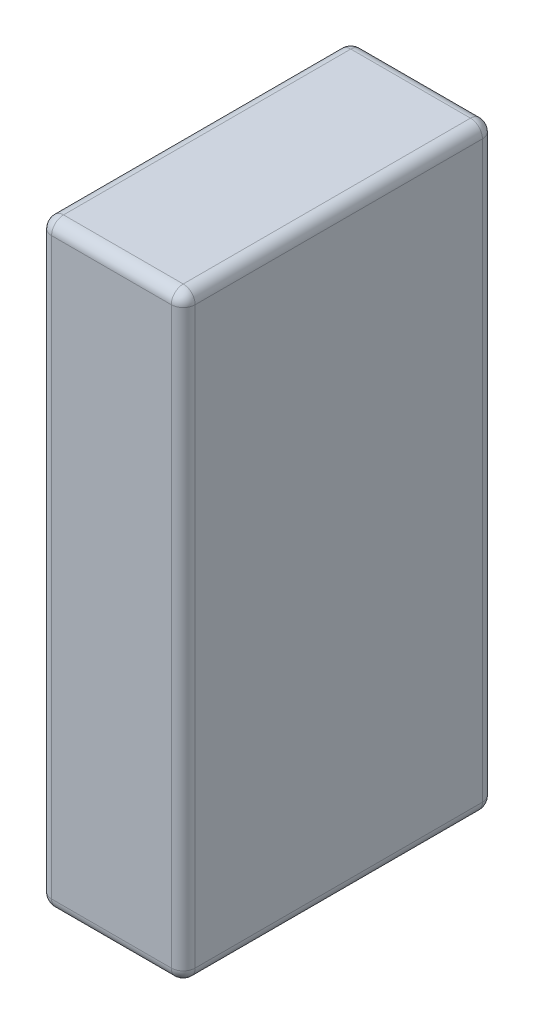
ISO-10303-21;
HEADER;
FILE_DESCRIPTION(('STEP AP214'),'2;1');
FILE_NAME('part.step','',(''),(''),'','','');
FILE_SCHEMA(('AUTOMOTIVE_DESIGN { 1 0 10303 214 1 1 1 1 }'));
ENDSEC;
DATA;
#1=APPLICATION_CONTEXT('core data for automotive mechanical design processes');
#2=APPLICATION_PROTOCOL_DEFINITION('international standard','automotive_design',2000,#1);
#3=PRODUCT_CONTEXT('',#1,'mechanical');
#4=PRODUCT('Part','Part','',(#3));
#5=PRODUCT_RELATED_PRODUCT_CATEGORY('part','',(#4));
#6=PRODUCT_DEFINITION_FORMATION('','',#4);
#7=PRODUCT_DEFINITION_CONTEXT('part definition',#1,'design');
#8=PRODUCT_DEFINITION('design','',#6,#7);
#9=PRODUCT_DEFINITION_SHAPE('','',#8);
#10=(LENGTH_UNIT() NAMED_UNIT(*) SI_UNIT(.MILLI.,.METRE.));
#11=(NAMED_UNIT(*) PLANE_ANGLE_UNIT() SI_UNIT($,.RADIAN.));
#12=(NAMED_UNIT(*) SI_UNIT($,.STERADIAN.) SOLID_ANGLE_UNIT());
#13=UNCERTAINTY_MEASURE_WITH_UNIT(LENGTH_MEASURE(1.E-05),#10,'distance_accuracy_value','');
#14=(GEOMETRIC_REPRESENTATION_CONTEXT(3) GLOBAL_UNCERTAINTY_ASSIGNED_CONTEXT((#13)) GLOBAL_UNIT_ASSIGNED_CONTEXT((#10,
#11,#12)) REPRESENTATION_CONTEXT('',''));
#15=CARTESIAN_POINT('',(0.,0.,0.));
#16=DIRECTION('',(0.,0.,1.));
#17=DIRECTION('',(1.,0.,0.));
#18=AXIS2_PLACEMENT_3D('',#15,#16,#17);
#19=CARTESIAN_POINT('',(60.,500.,130.));
#20=DIRECTION('',(-1.,0.,0.));
#21=DIRECTION('',(0.,0.,1.));
#22=AXIS2_PLACEMENT_3D('',#19,#20,#21);
#23=PLANE('',#22);
#24=DIRECTION('',(0.,0.,-1.));
#25=VECTOR('',#24,1.);
#26=CARTESIAN_POINT('',(60.,490.,130.));
#27=LINE('',#26,#25);
#28=CARTESIAN_POINT('',(60.,490.,-120.));
#29=VERTEX_POINT('',#28);
#30=CARTESIAN_POINT('',(60.,490.,120.));
#31=VERTEX_POINT('',#30);
#32=EDGE_CURVE('E48',#29,#31,#27,.F.);
#33=ORIENTED_EDGE('',*,*,#32,.T.);
#34=DIRECTION('',(0.,-1.,0.));
#35=VECTOR('',#34,1.);
#36=CARTESIAN_POINT('',(60.,500.,120.));
#37=LINE('',#36,#35);
#38=CARTESIAN_POINT('',(60.,10.,120.));
#39=VERTEX_POINT('',#38);
#40=EDGE_CURVE('E11',#31,#39,#37,.T.);
#41=ORIENTED_EDGE('',*,*,#40,.T.);
#42=DIRECTION('',(0.,0.,-1.));
#43=VECTOR('',#42,1.);
#44=CARTESIAN_POINT('',(60.,10.,-130.));
#45=LINE('',#44,#43);
#46=CARTESIAN_POINT('',(60.,10.,-120.));
#47=VERTEX_POINT('',#46);
#48=EDGE_CURVE('E204',#39,#47,#45,.T.);
#49=ORIENTED_EDGE('',*,*,#48,.T.);
#50=DIRECTION('',(0.,-1.,0.));
#51=VECTOR('',#50,1.);
#52=CARTESIAN_POINT('',(60.,500.,-120.));
#53=LINE('',#52,#51);
#54=EDGE_CURVE('E59',#47,#29,#53,.F.);
#55=ORIENTED_EDGE('',*,*,#54,.T.);
#56=EDGE_LOOP('',(#33,#41,#49,#55));
#57=FACE_BOUND('',#56,.T.);
#58=ADVANCED_FACE('F39',(#57),#23,.F.);
#59=CARTESIAN_POINT('',(-60.,500.,-130.));
#60=DIRECTION('',(0.,0.,1.));
#61=DIRECTION('',(1.,0.,0.));
#62=AXIS2_PLACEMENT_3D('',#59,#60,#61);
#63=PLANE('',#62);
#64=DIRECTION('',(-1.,0.,0.));
#65=VECTOR('',#64,1.);
#66=CARTESIAN_POINT('',(-60.,10.,-130.));
#67=LINE('',#66,#65);
#68=CARTESIAN_POINT('',(50.,10.,-130.));
#69=VERTEX_POINT('',#68);
#70=CARTESIAN_POINT('',(-50.,10.,-130.));
#71=VERTEX_POINT('',#70);
#72=EDGE_CURVE('E138',#69,#71,#67,.T.);
#73=ORIENTED_EDGE('',*,*,#72,.T.);
#74=DIRECTION('',(0.,-1.,0.));
#75=VECTOR('',#74,1.);
#76=CARTESIAN_POINT('',(-50.,500.,-130.));
#77=LINE('',#76,#75);
#78=CARTESIAN_POINT('',(-50.,490.,-130.));
#79=VERTEX_POINT('',#78);
#80=EDGE_CURVE('E134',#71,#79,#77,.F.);
#81=ORIENTED_EDGE('',*,*,#80,.T.);
#82=DIRECTION('',(-1.,0.,0.));
#83=VECTOR('',#82,1.);
#84=CARTESIAN_POINT('',(-60.,490.,-130.));
#85=LINE('',#84,#83);
#86=CARTESIAN_POINT('',(50.,490.,-130.));
#87=VERTEX_POINT('',#86);
#88=EDGE_CURVE('E126',#79,#87,#85,.F.);
#89=ORIENTED_EDGE('',*,*,#88,.T.);
#90=DIRECTION('',(0.,-1.,0.));
#91=VECTOR('',#90,1.);
#92=CARTESIAN_POINT('',(50.,500.,-130.));
#93=LINE('',#92,#91);
#94=EDGE_CURVE('E131',#87,#69,#93,.T.);
#95=ORIENTED_EDGE('',*,*,#94,.T.);
#96=EDGE_LOOP('',(#73,#81,#89,#95));
#97=FACE_BOUND('',#96,.T.);
#98=ADVANCED_FACE('F129',(#97),#63,.F.);
#99=CARTESIAN_POINT('',(-60.,500.,130.));
#100=DIRECTION('',(1.,0.,0.));
#101=DIRECTION('',(0.,0.,-1.));
#102=AXIS2_PLACEMENT_3D('',#99,#100,#101);
#103=PLANE('',#102);
#104=DIRECTION('',(0.,0.,1.));
#105=VECTOR('',#104,1.);
#106=CARTESIAN_POINT('',(-60.,490.,130.));
#107=LINE('',#106,#105);
#108=CARTESIAN_POINT('',(-60.,490.,120.));
#109=VERTEX_POINT('',#108);
#110=CARTESIAN_POINT('',(-60.,490.,-120.));
#111=VERTEX_POINT('',#110);
#112=EDGE_CURVE('E199',#109,#111,#107,.F.);
#113=ORIENTED_EDGE('',*,*,#112,.T.);
#114=DIRECTION('',(0.,-1.,0.));
#115=VECTOR('',#114,1.);
#116=CARTESIAN_POINT('',(-60.,500.,-120.));
#117=LINE('',#116,#115);
#118=CARTESIAN_POINT('',(-60.,10.,-120.));
#119=VERTEX_POINT('',#118);
#120=EDGE_CURVE('E201',#111,#119,#117,.T.);
#121=ORIENTED_EDGE('',*,*,#120,.T.);
#122=DIRECTION('',(0.,0.,1.));
#123=VECTOR('',#122,1.);
#124=CARTESIAN_POINT('',(-60.,10.,130.));
#125=LINE('',#124,#123);
#126=CARTESIAN_POINT('',(-60.,10.,120.));
#127=VERTEX_POINT('',#126);
#128=EDGE_CURVE('E195',#119,#127,#125,.T.);
#129=ORIENTED_EDGE('',*,*,#128,.T.);
#130=DIRECTION('',(0.,-1.,0.));
#131=VECTOR('',#130,1.);
#132=CARTESIAN_POINT('',(-60.,500.,120.));
#133=LINE('',#132,#131);
#134=EDGE_CURVE('E197',#127,#109,#133,.F.);
#135=ORIENTED_EDGE('',*,*,#134,.T.);
#136=EDGE_LOOP('',(#113,#121,#129,#135));
#137=FACE_BOUND('',#136,.T.);
#138=ADVANCED_FACE('F271',(#137),#103,.F.);
#139=CARTESIAN_POINT('',(-60.,500.,130.));
#140=DIRECTION('',(0.,0.,-1.));
#141=DIRECTION('',(-1.,0.,0.));
#142=AXIS2_PLACEMENT_3D('',#139,#140,#141);
#143=PLANE('',#142);
#144=DIRECTION('',(1.,0.,0.));
#145=VECTOR('',#144,1.);
#146=CARTESIAN_POINT('',(-60.,490.,130.));
#147=LINE('',#146,#145);
#148=CARTESIAN_POINT('',(50.,490.,130.));
#149=VERTEX_POINT('',#148);
#150=CARTESIAN_POINT('',(-50.,490.,130.));
#151=VERTEX_POINT('',#150);
#152=EDGE_CURVE('E180',#149,#151,#147,.F.);
#153=ORIENTED_EDGE('',*,*,#152,.T.);
#154=DIRECTION('',(0.,-1.,0.));
#155=VECTOR('',#154,1.);
#156=CARTESIAN_POINT('',(-50.,500.,130.));
#157=LINE('',#156,#155);
#158=CARTESIAN_POINT('',(-50.,10.,130.));
#159=VERTEX_POINT('',#158);
#160=EDGE_CURVE('E185',#151,#159,#157,.T.);
#161=ORIENTED_EDGE('',*,*,#160,.T.);
#162=DIRECTION('',(1.,0.,0.));
#163=VECTOR('',#162,1.);
#164=CARTESIAN_POINT('',(60.,10.,130.));
#165=LINE('',#164,#163);
#166=CARTESIAN_POINT('',(50.,10.,130.));
#167=VERTEX_POINT('',#166);
#168=EDGE_CURVE('E182',#159,#167,#165,.T.);
#169=ORIENTED_EDGE('',*,*,#168,.T.);
#170=DIRECTION('',(0.,-1.,0.));
#171=VECTOR('',#170,1.);
#172=CARTESIAN_POINT('',(50.,500.,130.));
#173=LINE('',#172,#171);
#174=EDGE_CURVE('E178',#167,#149,#173,.F.);
#175=ORIENTED_EDGE('',*,*,#174,.T.);
#176=EDGE_LOOP('',(#153,#161,#169,#175));
#177=FACE_BOUND('',#176,.T.);
#178=ADVANCED_FACE('F280',(#177),#143,.F.);
#179=CARTESIAN_POINT('',(0.,500.,0.));
#180=DIRECTION('',(0.,-1.,0.));
#181=DIRECTION('',(0.,0.,-1.));
#182=AXIS2_PLACEMENT_3D('',#179,#180,#181);
#183=PLANE('',#182);
#184=DIRECTION('',(-1.,0.,0.));
#185=VECTOR('',#184,1.);
#186=CARTESIAN_POINT('',(0.,500.,-120.));
#187=LINE('',#186,#185);
#188=CARTESIAN_POINT('',(50.,500.,-120.));
#189=VERTEX_POINT('',#188);
#190=CARTESIAN_POINT('',(-50.,500.,-120.));
#191=VERTEX_POINT('',#190);
#192=EDGE_CURVE('E145',#189,#191,#187,.T.);
#193=ORIENTED_EDGE('',*,*,#192,.T.);
#194=DIRECTION('',(0.,0.,1.));
#195=VECTOR('',#194,1.);
#196=CARTESIAN_POINT('',(-50.,500.,0.));
#197=LINE('',#196,#195);
#198=CARTESIAN_POINT('',(-50.,500.,120.));
#199=VERTEX_POINT('',#198);
#200=EDGE_CURVE('E193',#191,#199,#197,.T.);
#201=ORIENTED_EDGE('',*,*,#200,.T.);
#202=DIRECTION('',(1.,0.,0.));
#203=VECTOR('',#202,1.);
#204=CARTESIAN_POINT('',(0.,500.,120.));
#205=LINE('',#204,#203);
#206=CARTESIAN_POINT('',(50.,500.,120.));
#207=VERTEX_POINT('',#206);
#208=EDGE_CURVE('E190',#199,#207,#205,.T.);
#209=ORIENTED_EDGE('',*,*,#208,.T.);
#210=DIRECTION('',(0.,0.,-1.));
#211=VECTOR('',#210,1.);
#212=CARTESIAN_POINT('',(50.,500.,0.));
#213=LINE('',#212,#211);
#214=EDGE_CURVE('E187',#207,#189,#213,.T.);
#215=ORIENTED_EDGE('',*,*,#214,.T.);
#216=EDGE_LOOP('',(#193,#201,#209,#215));
#217=FACE_BOUND('',#216,.T.);
#218=ADVANCED_FACE('F302',(#217),#183,.F.);
#219=CARTESIAN_POINT('',(0.,0.,0.));
#220=DIRECTION('',(0.,-1.,0.));
#221=DIRECTION('',(0.,0.,-1.));
#222=AXIS2_PLACEMENT_3D('',#219,#220,#221);
#223=PLANE('',#222);
#224=DIRECTION('',(1.,0.,0.));
#225=VECTOR('',#224,1.);
#226=CARTESIAN_POINT('',(-60.,0.,120.));
#227=LINE('',#226,#225);
#228=CARTESIAN_POINT('',(50.,0.,120.));
#229=VERTEX_POINT('',#228);
#230=CARTESIAN_POINT('',(-50.,0.,120.));
#231=VERTEX_POINT('',#230);
#232=EDGE_CURVE('E171',#229,#231,#227,.F.);
#233=ORIENTED_EDGE('',*,*,#232,.T.);
#234=DIRECTION('',(0.,0.,1.));
#235=VECTOR('',#234,1.);
#236=CARTESIAN_POINT('',(-50.,0.,-130.));
#237=LINE('',#236,#235);
#238=CARTESIAN_POINT('',(-50.,0.,-120.));
#239=VERTEX_POINT('',#238);
#240=EDGE_CURVE('E176',#231,#239,#237,.F.);
#241=ORIENTED_EDGE('',*,*,#240,.T.);
#242=DIRECTION('',(-1.,0.,0.));
#243=VECTOR('',#242,1.);
#244=CARTESIAN_POINT('',(60.,0.,-120.));
#245=LINE('',#244,#243);
#246=CARTESIAN_POINT('',(50.,0.,-120.));
#247=VERTEX_POINT('',#246);
#248=EDGE_CURVE('E173',#239,#247,#245,.F.);
#249=ORIENTED_EDGE('',*,*,#248,.T.);
#250=DIRECTION('',(0.,0.,-1.));
#251=VECTOR('',#250,1.);
#252=CARTESIAN_POINT('',(50.,0.,130.));
#253=LINE('',#252,#251);
#254=EDGE_CURVE('E169',#247,#229,#253,.F.);
#255=ORIENTED_EDGE('',*,*,#254,.T.);
#256=EDGE_LOOP('',(#233,#241,#249,#255));
#257=FACE_BOUND('',#256,.T.);
#258=ADVANCED_FACE('F304',(#257),#223,.T.);
#259=CARTESIAN_POINT('',(0.,490.,120.));
#260=DIRECTION('',(1.,0.,0.));
#261=DIRECTION('',(0.,0.,-1.));
#262=AXIS2_PLACEMENT_3D('',#259,#260,#261);
#263=CYLINDRICAL_SURFACE('',#262,10.);
#264=CARTESIAN_POINT('',(50.,490.,120.));
#265=DIRECTION('',(1.,0.,0.));
#266=DIRECTION('',(0.,0.,-1.));
#267=AXIS2_PLACEMENT_3D('',#264,#265,#266);
#268=CIRCLE('',#267,10.);
#269=EDGE_CURVE('E43',#207,#149,#268,.T.);
#270=ORIENTED_EDGE('',*,*,#269,.F.);
#271=ORIENTED_EDGE('',*,*,#208,.F.);
#272=CARTESIAN_POINT('',(-50.,490.,120.));
#273=DIRECTION('',(-1.,0.,0.));
#274=DIRECTION('',(0.,0.,1.));
#275=AXIS2_PLACEMENT_3D('',#272,#273,#274);
#276=CIRCLE('',#275,10.);
#277=EDGE_CURVE('E165',#151,#199,#276,.T.);
#278=ORIENTED_EDGE('',*,*,#277,.F.);
#279=ORIENTED_EDGE('',*,*,#152,.F.);
#280=EDGE_LOOP('',(#270,#271,#278,#279));
#281=FACE_BOUND('',#280,.T.);
#282=ADVANCED_FACE('F41',(#281),#263,.T.);
#283=CARTESIAN_POINT('',(50.,490.,120.));
#284=DIRECTION('',(0.,0.,1.));
#285=DIRECTION('',(1.,0.,0.));
#286=AXIS2_PLACEMENT_3D('',#283,#284,#285);
#287=SPHERICAL_SURFACE('',#286,10.);
#288=CARTESIAN_POINT('',(50.,490.,120.));
#289=DIRECTION('',(0.,0.,1.));
#290=DIRECTION('',(1.,0.,0.));
#291=AXIS2_PLACEMENT_3D('',#288,#289,#290);
#292=CIRCLE('',#291,10.);
#293=EDGE_CURVE('E250',#207,#31,#292,.F.);
#294=ORIENTED_EDGE('',*,*,#293,.F.);
#295=ORIENTED_EDGE('',*,*,#269,.T.);
#296=CARTESIAN_POINT('',(50.,490.,120.));
#297=DIRECTION('',(0.,1.,0.));
#298=DIRECTION('',(0.,0.,1.));
#299=AXIS2_PLACEMENT_3D('',#296,#297,#298);
#300=CIRCLE('',#299,10.);
#301=EDGE_CURVE('E252',#31,#149,#300,.F.);
#302=ORIENTED_EDGE('',*,*,#301,.F.);
#303=EDGE_LOOP('',(#294,#295,#302));
#304=FACE_BOUND('',#303,.T.);
#305=ADVANCED_FACE('F298',(#304),#287,.T.);
#306=CARTESIAN_POINT('',(-50.,490.,120.));
#307=DIRECTION('',(0.,1.,0.));
#308=DIRECTION('',(0.,0.,1.));
#309=AXIS2_PLACEMENT_3D('',#306,#307,#308);
#310=SPHERICAL_SURFACE('',#309,10.);
#311=CARTESIAN_POINT('',(-50.,490.,120.));
#312=DIRECTION('',(0.,1.,0.));
#313=DIRECTION('',(0.,0.,1.));
#314=AXIS2_PLACEMENT_3D('',#311,#312,#313);
#315=CIRCLE('',#314,10.);
#316=EDGE_CURVE('E244',#151,#109,#315,.F.);
#317=ORIENTED_EDGE('',*,*,#316,.F.);
#318=ORIENTED_EDGE('',*,*,#277,.T.);
#319=CARTESIAN_POINT('',(-50.,490.,120.));
#320=DIRECTION('',(0.,0.,1.));
#321=DIRECTION('',(1.,0.,0.));
#322=AXIS2_PLACEMENT_3D('',#319,#320,#321);
#323=CIRCLE('',#322,10.);
#324=EDGE_CURVE('E247',#109,#199,#323,.F.);
#325=ORIENTED_EDGE('',*,*,#324,.F.);
#326=EDGE_LOOP('',(#317,#318,#325));
#327=FACE_BOUND('',#326,.T.);
#328=ADVANCED_FACE('F259',(#327),#310,.T.);
#329=CARTESIAN_POINT('',(50.,500.,120.));
#330=DIRECTION('',(0.,-1.,0.));
#331=DIRECTION('',(0.,0.,-1.));
#332=AXIS2_PLACEMENT_3D('',#329,#330,#331);
#333=CYLINDRICAL_SURFACE('',#332,10.);
#334=ORIENTED_EDGE('',*,*,#301,.T.);
#335=ORIENTED_EDGE('',*,*,#174,.F.);
#336=CARTESIAN_POINT('',(50.,10.,120.));
#337=DIRECTION('',(0.,-1.,0.));
#338=DIRECTION('',(0.,0.,-1.));
#339=AXIS2_PLACEMENT_3D('',#336,#337,#338);
#340=CIRCLE('',#339,10.);
#341=EDGE_CURVE('E239',#39,#167,#340,.T.);
#342=ORIENTED_EDGE('',*,*,#341,.F.);
#343=ORIENTED_EDGE('',*,*,#40,.F.);
#344=EDGE_LOOP('',(#334,#335,#342,#343));
#345=FACE_BOUND('',#344,.T.);
#346=ADVANCED_FACE('F292',(#345),#333,.T.);
#347=CARTESIAN_POINT('',(50.,490.,0.));
#348=DIRECTION('',(0.,0.,-1.));
#349=DIRECTION('',(-1.,0.,0.));
#350=AXIS2_PLACEMENT_3D('',#347,#348,#349);
#351=CYLINDRICAL_SURFACE('',#350,10.);
#352=ORIENTED_EDGE('',*,*,#293,.T.);
#353=ORIENTED_EDGE('',*,*,#32,.F.);
#354=CARTESIAN_POINT('',(50.,490.,-120.));
#355=DIRECTION('',(0.,0.,-1.));
#356=DIRECTION('',(-1.,0.,0.));
#357=AXIS2_PLACEMENT_3D('',#354,#355,#356);
#358=CIRCLE('',#357,10.);
#359=EDGE_CURVE('E149',#189,#29,#358,.T.);
#360=ORIENTED_EDGE('',*,*,#359,.F.);
#361=ORIENTED_EDGE('',*,*,#214,.F.);
#362=EDGE_LOOP('',(#352,#353,#360,#361));
#363=FACE_BOUND('',#362,.T.);
#364=ADVANCED_FACE('F300',(#363),#351,.T.);
#365=CARTESIAN_POINT('',(0.,490.,-120.));
#366=DIRECTION('',(-1.,0.,0.));
#367=DIRECTION('',(0.,0.,1.));
#368=AXIS2_PLACEMENT_3D('',#365,#366,#367);
#369=CYLINDRICAL_SURFACE('',#368,10.);
#370=CARTESIAN_POINT('',(-50.,490.,-120.));
#371=DIRECTION('',(-1.,0.,0.));
#372=DIRECTION('',(0.,0.,1.));
#373=AXIS2_PLACEMENT_3D('',#370,#371,#372);
#374=CIRCLE('',#373,10.);
#375=EDGE_CURVE('E150',#191,#79,#374,.T.);
#376=ORIENTED_EDGE('',*,*,#375,.F.);
#377=ORIENTED_EDGE('',*,*,#192,.F.);
#378=CARTESIAN_POINT('',(50.,490.,-120.));
#379=DIRECTION('',(1.,0.,0.));
#380=DIRECTION('',(0.,0.,-1.));
#381=AXIS2_PLACEMENT_3D('',#378,#379,#380);
#382=CIRCLE('',#381,10.);
#383=EDGE_CURVE('E142',#87,#189,#382,.T.);
#384=ORIENTED_EDGE('',*,*,#383,.F.);
#385=ORIENTED_EDGE('',*,*,#88,.F.);
#386=EDGE_LOOP('',(#376,#377,#384,#385));
#387=FACE_BOUND('',#386,.T.);
#388=ADVANCED_FACE('F144',(#387),#369,.T.);
#389=CARTESIAN_POINT('',(-50.,490.,0.));
#390=DIRECTION('',(0.,0.,1.));
#391=DIRECTION('',(1.,0.,0.));
#392=AXIS2_PLACEMENT_3D('',#389,#390,#391);
#393=CYLINDRICAL_SURFACE('',#392,10.);
#394=ORIENTED_EDGE('',*,*,#324,.T.);
#395=ORIENTED_EDGE('',*,*,#200,.F.);
#396=CARTESIAN_POINT('',(-50.,490.,-120.));
#397=DIRECTION('',(0.,0.,-1.));
#398=DIRECTION('',(0.,1.,0.));
#399=AXIS2_PLACEMENT_3D('',#396,#397,#398);
#400=CIRCLE('',#399,10.);
#401=EDGE_CURVE('E234',#111,#191,#400,.T.);
#402=ORIENTED_EDGE('',*,*,#401,.F.);
#403=ORIENTED_EDGE('',*,*,#112,.F.);
#404=EDGE_LOOP('',(#394,#395,#402,#403));
#405=FACE_BOUND('',#404,.T.);
#406=ADVANCED_FACE('F267',(#405),#393,.T.);
#407=CARTESIAN_POINT('',(-50.,500.,120.));
#408=DIRECTION('',(0.,-1.,0.));
#409=DIRECTION('',(0.,0.,-1.));
#410=AXIS2_PLACEMENT_3D('',#407,#408,#409);
#411=CYLINDRICAL_SURFACE('',#410,10.);
#412=ORIENTED_EDGE('',*,*,#316,.T.);
#413=ORIENTED_EDGE('',*,*,#134,.F.);
#414=CARTESIAN_POINT('',(-50.,10.,120.));
#415=DIRECTION('',(0.,-1.,0.));
#416=DIRECTION('',(0.,0.,-1.));
#417=AXIS2_PLACEMENT_3D('',#414,#415,#416);
#418=CIRCLE('',#417,10.);
#419=EDGE_CURVE('E231',#159,#127,#418,.T.);
#420=ORIENTED_EDGE('',*,*,#419,.F.);
#421=ORIENTED_EDGE('',*,*,#160,.F.);
#422=EDGE_LOOP('',(#412,#413,#420,#421));
#423=FACE_BOUND('',#422,.T.);
#424=ADVANCED_FACE('F277',(#423),#411,.T.);
#425=CARTESIAN_POINT('',(-60.,10.,120.));
#426=DIRECTION('',(-1.,0.,0.));
#427=DIRECTION('',(0.,0.,1.));
#428=AXIS2_PLACEMENT_3D('',#425,#426,#427);
#429=CYLINDRICAL_SURFACE('',#428,10.);
#430=CARTESIAN_POINT('',(50.,10.,120.));
#431=DIRECTION('',(1.,0.,0.));
#432=DIRECTION('',(0.,0.,-1.));
#433=AXIS2_PLACEMENT_3D('',#430,#431,#432);
#434=CIRCLE('',#433,10.);
#435=EDGE_CURVE('E241',#167,#229,#434,.T.);
#436=ORIENTED_EDGE('',*,*,#435,.F.);
#437=ORIENTED_EDGE('',*,*,#168,.F.);
#438=CARTESIAN_POINT('',(-50.,10.,120.));
#439=DIRECTION('',(-1.,0.,0.));
#440=DIRECTION('',(0.,0.,1.));
#441=AXIS2_PLACEMENT_3D('',#438,#439,#440);
#442=CIRCLE('',#441,10.);
#443=EDGE_CURVE('E228',#231,#159,#442,.T.);
#444=ORIENTED_EDGE('',*,*,#443,.F.);
#445=ORIENTED_EDGE('',*,*,#232,.F.);
#446=EDGE_LOOP('',(#436,#437,#444,#445));
#447=FACE_BOUND('',#446,.T.);
#448=ADVANCED_FACE('F284',(#447),#429,.T.);
#449=CARTESIAN_POINT('',(50.,10.,120.));
#450=DIRECTION('',(0.,0.,1.));
#451=DIRECTION('',(0.,-1.,0.));
#452=AXIS2_PLACEMENT_3D('',#449,#450,#451);
#453=SPHERICAL_SURFACE('',#452,10.);
#454=ORIENTED_EDGE('',*,*,#341,.T.);
#455=ORIENTED_EDGE('',*,*,#435,.T.);
#456=CARTESIAN_POINT('',(50.,10.,120.));
#457=DIRECTION('',(0.,0.,1.));
#458=DIRECTION('',(1.,0.,0.));
#459=AXIS2_PLACEMENT_3D('',#456,#457,#458);
#460=CIRCLE('',#459,10.);
#461=EDGE_CURVE('E156',#39,#229,#460,.F.);
#462=ORIENTED_EDGE('',*,*,#461,.F.);
#463=EDGE_LOOP('',(#454,#455,#462));
#464=FACE_BOUND('',#463,.T.);
#465=ADVANCED_FACE('F357',(#464),#453,.T.);
#466=CARTESIAN_POINT('',(50.,490.,-120.));
#467=DIRECTION('',(0.,1.,0.));
#468=DIRECTION('',(0.,0.,1.));
#469=AXIS2_PLACEMENT_3D('',#466,#467,#468);
#470=SPHERICAL_SURFACE('',#469,10.);
#471=ORIENTED_EDGE('',*,*,#383,.T.);
#472=ORIENTED_EDGE('',*,*,#359,.T.);
#473=CARTESIAN_POINT('',(50.,490.,-120.));
#474=DIRECTION('',(0.,1.,0.));
#475=DIRECTION('',(0.,0.,1.));
#476=AXIS2_PLACEMENT_3D('',#473,#474,#475);
#477=CIRCLE('',#476,10.);
#478=EDGE_CURVE('E153',#87,#29,#477,.F.);
#479=ORIENTED_EDGE('',*,*,#478,.F.);
#480=EDGE_LOOP('',(#471,#472,#479));
#481=FACE_BOUND('',#480,.T.);
#482=ADVANCED_FACE('F154',(#481),#470,.T.);
#483=CARTESIAN_POINT('',(-50.,490.,-120.));
#484=DIRECTION('',(0.,1.,0.));
#485=DIRECTION('',(0.,0.,1.));
#486=AXIS2_PLACEMENT_3D('',#483,#484,#485);
#487=SPHERICAL_SURFACE('',#486,10.);
#488=ORIENTED_EDGE('',*,*,#401,.T.);
#489=ORIENTED_EDGE('',*,*,#375,.T.);
#490=CARTESIAN_POINT('',(-50.,490.,-120.));
#491=DIRECTION('',(0.,1.,0.));
#492=DIRECTION('',(0.,0.,1.));
#493=AXIS2_PLACEMENT_3D('',#490,#491,#492);
#494=CIRCLE('',#493,10.);
#495=EDGE_CURVE('E157',#111,#79,#494,.F.);
#496=ORIENTED_EDGE('',*,*,#495,.F.);
#497=EDGE_LOOP('',(#488,#489,#496));
#498=FACE_BOUND('',#497,.T.);
#499=ADVANCED_FACE('F350',(#498),#487,.T.);
#500=CARTESIAN_POINT('',(-50.,10.,120.));
#501=DIRECTION('',(0.,0.,1.));
#502=DIRECTION('',(0.,-1.,0.));
#503=AXIS2_PLACEMENT_3D('',#500,#501,#502);
#504=SPHERICAL_SURFACE('',#503,10.);
#505=ORIENTED_EDGE('',*,*,#443,.T.);
#506=ORIENTED_EDGE('',*,*,#419,.T.);
#507=CARTESIAN_POINT('',(-50.,10.,120.));
#508=DIRECTION('',(0.,0.,1.));
#509=DIRECTION('',(1.,0.,0.));
#510=AXIS2_PLACEMENT_3D('',#507,#508,#509);
#511=CIRCLE('',#510,10.);
#512=EDGE_CURVE('E221',#231,#127,#511,.F.);
#513=ORIENTED_EDGE('',*,*,#512,.F.);
#514=EDGE_LOOP('',(#505,#506,#513));
#515=FACE_BOUND('',#514,.T.);
#516=ADVANCED_FACE('F346',(#515),#504,.T.);
#517=CARTESIAN_POINT('',(50.,10.,130.));
#518=DIRECTION('',(0.,0.,1.));
#519=DIRECTION('',(1.,0.,0.));
#520=AXIS2_PLACEMENT_3D('',#517,#518,#519);
#521=CYLINDRICAL_SURFACE('',#520,10.);
#522=ORIENTED_EDGE('',*,*,#461,.T.);
#523=ORIENTED_EDGE('',*,*,#254,.F.);
#524=CARTESIAN_POINT('',(50.,10.,-120.));
#525=DIRECTION('',(0.,0.,-1.));
#526=DIRECTION('',(-1.,0.,0.));
#527=AXIS2_PLACEMENT_3D('',#524,#525,#526);
#528=CIRCLE('',#527,10.);
#529=EDGE_CURVE('E218',#47,#247,#528,.T.);
#530=ORIENTED_EDGE('',*,*,#529,.F.);
#531=ORIENTED_EDGE('',*,*,#48,.F.);
#532=EDGE_LOOP('',(#522,#523,#530,#531));
#533=FACE_BOUND('',#532,.T.);
#534=ADVANCED_FACE('F343',(#533),#521,.T.);
#535=CARTESIAN_POINT('',(50.,500.,-120.));
#536=DIRECTION('',(0.,-1.,0.));
#537=DIRECTION('',(0.,0.,-1.));
#538=AXIS2_PLACEMENT_3D('',#535,#536,#537);
#539=CYLINDRICAL_SURFACE('',#538,10.);
#540=ORIENTED_EDGE('',*,*,#478,.T.);
#541=ORIENTED_EDGE('',*,*,#54,.F.);
#542=CARTESIAN_POINT('',(50.,10.,-120.));
#543=DIRECTION('',(0.,-1.,0.));
#544=DIRECTION('',(0.,0.,-1.));
#545=AXIS2_PLACEMENT_3D('',#542,#543,#544);
#546=CIRCLE('',#545,10.);
#547=EDGE_CURVE('E161',#69,#47,#546,.T.);
#548=ORIENTED_EDGE('',*,*,#547,.F.);
#549=ORIENTED_EDGE('',*,*,#94,.F.);
#550=EDGE_LOOP('',(#540,#541,#548,#549));
#551=FACE_BOUND('',#550,.T.);
#552=ADVANCED_FACE('F159',(#551),#539,.T.);
#553=CARTESIAN_POINT('',(-50.,500.,-120.));
#554=DIRECTION('',(0.,-1.,0.));
#555=DIRECTION('',(0.,0.,-1.));
#556=AXIS2_PLACEMENT_3D('',#553,#554,#555);
#557=CYLINDRICAL_SURFACE('',#556,10.);
#558=ORIENTED_EDGE('',*,*,#495,.T.);
#559=ORIENTED_EDGE('',*,*,#80,.F.);
#560=CARTESIAN_POINT('',(-50.,10.,-120.));
#561=DIRECTION('',(0.,-1.,0.));
#562=DIRECTION('',(0.,0.,-1.));
#563=AXIS2_PLACEMENT_3D('',#560,#561,#562);
#564=CIRCLE('',#563,10.);
#565=EDGE_CURVE('E214',#119,#71,#564,.T.);
#566=ORIENTED_EDGE('',*,*,#565,.F.);
#567=ORIENTED_EDGE('',*,*,#120,.F.);
#568=EDGE_LOOP('',(#558,#559,#566,#567));
#569=FACE_BOUND('',#568,.T.);
#570=ADVANCED_FACE('F336',(#569),#557,.T.);
#571=CARTESIAN_POINT('',(-50.,10.,130.));
#572=DIRECTION('',(0.,0.,-1.));
#573=DIRECTION('',(-1.,0.,0.));
#574=AXIS2_PLACEMENT_3D('',#571,#572,#573);
#575=CYLINDRICAL_SURFACE('',#574,10.);
#576=ORIENTED_EDGE('',*,*,#512,.T.);
#577=ORIENTED_EDGE('',*,*,#128,.F.);
#578=CARTESIAN_POINT('',(-50.,10.,-120.));
#579=DIRECTION('',(0.,0.,-1.));
#580=DIRECTION('',(-1.,0.,0.));
#581=AXIS2_PLACEMENT_3D('',#578,#579,#580);
#582=CIRCLE('',#581,10.);
#583=EDGE_CURVE('E212',#239,#119,#582,.T.);
#584=ORIENTED_EDGE('',*,*,#583,.F.);
#585=ORIENTED_EDGE('',*,*,#240,.F.);
#586=EDGE_LOOP('',(#576,#577,#584,#585));
#587=FACE_BOUND('',#586,.T.);
#588=ADVANCED_FACE('F332',(#587),#575,.T.);
#589=CARTESIAN_POINT('',(50.,10.,-120.));
#590=DIRECTION('',(1.,0.,0.));
#591=DIRECTION('',(0.,1.,0.));
#592=AXIS2_PLACEMENT_3D('',#589,#590,#591);
#593=SPHERICAL_SURFACE('',#592,10.);
#594=ORIENTED_EDGE('',*,*,#547,.T.);
#595=ORIENTED_EDGE('',*,*,#529,.T.);
#596=CARTESIAN_POINT('',(50.,10.,-120.));
#597=DIRECTION('',(1.,0.,0.));
#598=DIRECTION('',(0.,0.,-1.));
#599=AXIS2_PLACEMENT_3D('',#596,#597,#598);
#600=CIRCLE('',#599,10.);
#601=EDGE_CURVE('E210',#69,#247,#600,.F.);
#602=ORIENTED_EDGE('',*,*,#601,.F.);
#603=EDGE_LOOP('',(#594,#595,#602));
#604=FACE_BOUND('',#603,.T.);
#605=ADVANCED_FACE('F328',(#604),#593,.T.);
#606=CARTESIAN_POINT('',(-50.,10.,-120.));
#607=DIRECTION('',(-1.,0.,0.));
#608=DIRECTION('',(0.,0.,1.));
#609=AXIS2_PLACEMENT_3D('',#606,#607,#608);
#610=SPHERICAL_SURFACE('',#609,10.);
#611=ORIENTED_EDGE('',*,*,#583,.T.);
#612=ORIENTED_EDGE('',*,*,#565,.T.);
#613=CARTESIAN_POINT('',(-50.,10.,-120.));
#614=DIRECTION('',(-1.,0.,0.));
#615=DIRECTION('',(0.,0.,1.));
#616=AXIS2_PLACEMENT_3D('',#613,#614,#615);
#617=CIRCLE('',#616,10.);
#618=EDGE_CURVE('E208',#239,#71,#617,.F.);
#619=ORIENTED_EDGE('',*,*,#618,.F.);
#620=EDGE_LOOP('',(#611,#612,#619));
#621=FACE_BOUND('',#620,.T.);
#622=ADVANCED_FACE('F324',(#621),#610,.T.);
#623=CARTESIAN_POINT('',(-60.,10.,-120.));
#624=DIRECTION('',(1.,0.,0.));
#625=DIRECTION('',(0.,0.,-1.));
#626=AXIS2_PLACEMENT_3D('',#623,#624,#625);
#627=CYLINDRICAL_SURFACE('',#626,10.);
#628=ORIENTED_EDGE('',*,*,#601,.T.);
#629=ORIENTED_EDGE('',*,*,#248,.F.);
#630=ORIENTED_EDGE('',*,*,#618,.T.);
#631=ORIENTED_EDGE('',*,*,#72,.F.);
#632=EDGE_LOOP('',(#628,#629,#630,#631));
#633=FACE_BOUND('',#632,.T.);
#634=ADVANCED_FACE('F321',(#633),#627,.T.);
#635=CLOSED_SHELL('',(#58,#98,#138,#178,#218,#258,#282,#305,#328,#346,#364,#388,#406,#424,#448,
#465,#482,#499,#516,#534,#552,#570,#588,#605,#622,#634));
#636=MANIFOLD_SOLID_BREP('B2',#635);
#637=ADVANCED_BREP_SHAPE_REPRESENTATION('',(#18,#636),#14);
#638=SHAPE_DEFINITION_REPRESENTATION(#9,#637);
ENDSEC;
END-ISO-10303-21;
